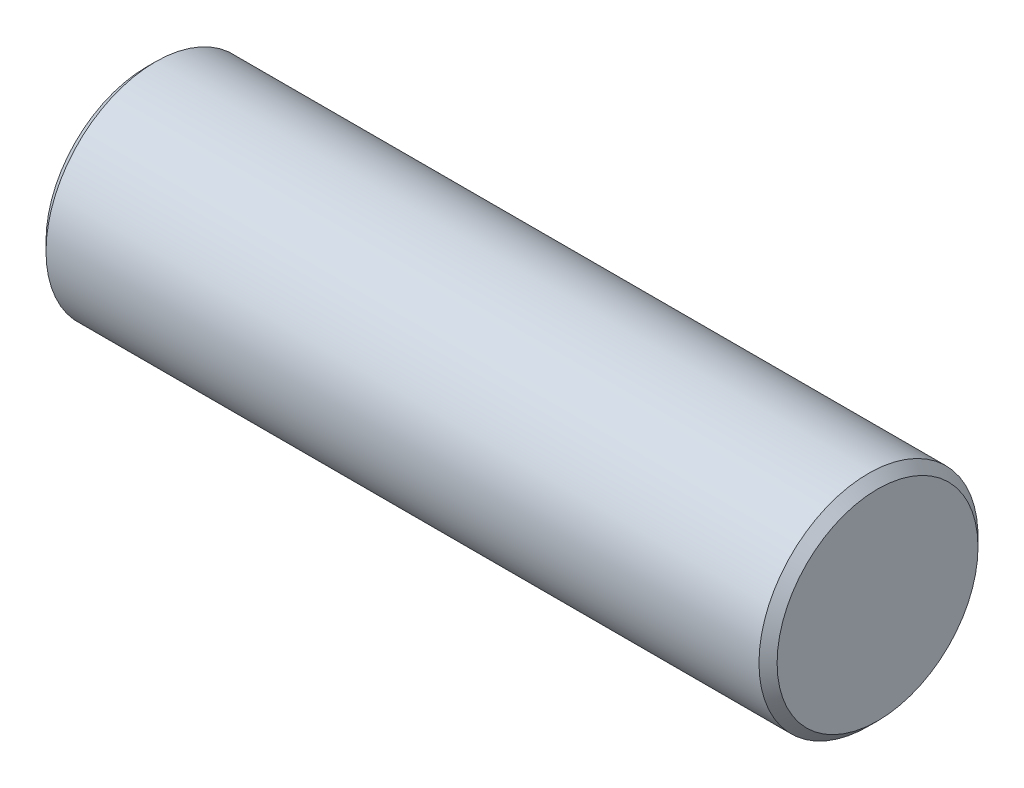
ISO-10303-21;
HEADER;
FILE_DESCRIPTION(('STEP AP214'),'2;1');
FILE_NAME('part.step','',(''),(''),'','','');
FILE_SCHEMA(('AUTOMOTIVE_DESIGN { 1 0 10303 214 1 1 1 1 }'));
ENDSEC;
DATA;
#1=APPLICATION_CONTEXT('core data for automotive mechanical design processes');
#2=APPLICATION_PROTOCOL_DEFINITION('international standard','automotive_design',2000,#1);
#3=PRODUCT_CONTEXT('',#1,'mechanical');
#4=PRODUCT('Part','Part','',(#3));
#5=PRODUCT_RELATED_PRODUCT_CATEGORY('part','',(#4));
#6=PRODUCT_DEFINITION_FORMATION('','',#4);
#7=PRODUCT_DEFINITION_CONTEXT('part definition',#1,'design');
#8=PRODUCT_DEFINITION('design','',#6,#7);
#9=PRODUCT_DEFINITION_SHAPE('','',#8);
#10=(LENGTH_UNIT() NAMED_UNIT(*) SI_UNIT(.MILLI.,.METRE.));
#11=(NAMED_UNIT(*) PLANE_ANGLE_UNIT() SI_UNIT($,.RADIAN.));
#12=(NAMED_UNIT(*) SI_UNIT($,.STERADIAN.) SOLID_ANGLE_UNIT());
#13=UNCERTAINTY_MEASURE_WITH_UNIT(LENGTH_MEASURE(1.E-05),#10,'distance_accuracy_value','');
#14=(GEOMETRIC_REPRESENTATION_CONTEXT(3) GLOBAL_UNCERTAINTY_ASSIGNED_CONTEXT((#13)) GLOBAL_UNIT_ASSIGNED_CONTEXT((#10,
#11,#12)) REPRESENTATION_CONTEXT('',''));
#15=CARTESIAN_POINT('',(0.,0.,0.));
#16=DIRECTION('',(0.,0.,1.));
#17=DIRECTION('',(1.,0.,0.));
#18=AXIS2_PLACEMENT_3D('',#15,#16,#17);
#19=CARTESIAN_POINT('',(-2.5,0.749,0.));
#20=DIRECTION('',(1.,0.,0.));
#21=DIRECTION('',(0.,0.,-1.));
#22=AXIS2_PLACEMENT_3D('',#19,#20,#21);
#23=PLANE('',#22);
#24=CARTESIAN_POINT('',(-2.5,0.,0.));
#25=DIRECTION('',(1.,0.,0.));
#26=DIRECTION('',(0.,0.,-1.));
#27=AXIS2_PLACEMENT_3D('',#24,#25,#26);
#28=CIRCLE('',#27,0.687000000000001);
#29=CARTESIAN_POINT('',(-2.5,0.,-0.687000000000001));
#30=VERTEX_POINT('',#29);
#31=EDGE_CURVE('E10',#30,#30,#28,.F.);
#32=ORIENTED_EDGE('',*,*,#31,.T.);
#33=EDGE_LOOP('',(#32));
#34=FACE_BOUND('',#33,.T.);
#35=ADVANCED_FACE('F37',(#34),#23,.F.);
#36=CARTESIAN_POINT('',(2.5,0.749,0.));
#37=DIRECTION('',(-1.,0.,0.));
#38=DIRECTION('',(0.,0.,1.));
#39=AXIS2_PLACEMENT_3D('',#36,#37,#38);
#40=PLANE('',#39);
#41=CARTESIAN_POINT('',(2.5,0.,0.));
#42=DIRECTION('',(-1.,0.,0.));
#43=DIRECTION('',(0.,0.,1.));
#44=AXIS2_PLACEMENT_3D('',#41,#42,#43);
#45=CIRCLE('',#44,0.687000000000002);
#46=CARTESIAN_POINT('',(2.5,0.,0.687000000000002));
#47=VERTEX_POINT('',#46);
#48=EDGE_CURVE('E45',#47,#47,#45,.F.);
#49=ORIENTED_EDGE('',*,*,#48,.T.);
#50=EDGE_LOOP('',(#49));
#51=FACE_BOUND('',#50,.T.);
#52=ADVANCED_FACE('F69',(#51),#40,.F.);
#53=CARTESIAN_POINT('',(-2.3127458107563,0.,0.));
#54=DIRECTION('',(-1.,0.,0.));
#55=DIRECTION('',(0.,0.,1.));
#56=AXIS2_PLACEMENT_3D('',#53,#54,#55);
#57=CYLINDRICAL_SURFACE('',#56,0.749);
#58=CARTESIAN_POINT('',(2.438,0.,0.));
#59=DIRECTION('',(-1.,0.,0.));
#60=DIRECTION('',(0.,0.,1.));
#61=AXIS2_PLACEMENT_3D('',#58,#59,#60);
#62=CIRCLE('',#61,0.749);
#63=CARTESIAN_POINT('',(2.438,0.,0.749));
#64=VERTEX_POINT('',#63);
#65=EDGE_CURVE('E49',#64,#64,#62,.T.);
#66=ORIENTED_EDGE('',*,*,#65,.T.);
#67=EDGE_LOOP('',(#66));
#68=FACE_BOUND('',#67,.T.);
#69=CARTESIAN_POINT('',(-2.438,0.,0.));
#70=DIRECTION('',(1.,0.,0.));
#71=DIRECTION('',(0.,0.,-1.));
#72=AXIS2_PLACEMENT_3D('',#69,#70,#71);
#73=CIRCLE('',#72,0.749);
#74=CARTESIAN_POINT('',(-2.438,0.,-0.749));
#75=VERTEX_POINT('',#74);
#76=EDGE_CURVE('E53',#75,#75,#73,.T.);
#77=ORIENTED_EDGE('',*,*,#76,.T.);
#78=EDGE_LOOP('',(#77));
#79=FACE_BOUND('',#78,.T.);
#80=ADVANCED_FACE('F59',(#68,#79),#57,.T.);
#81=CARTESIAN_POINT('',(2.438,0.,0.));
#82=DIRECTION('',(-1.,0.,0.));
#83=DIRECTION('',(0.,0.,1.));
#84=AXIS2_PLACEMENT_3D('',#81,#82,#83);
#85=CONICAL_SURFACE('',#84,0.749,0.785398163397441);
#86=ORIENTED_EDGE('',*,*,#48,.F.);
#87=EDGE_LOOP('',(#86));
#88=FACE_BOUND('',#87,.T.);
#89=ORIENTED_EDGE('',*,*,#65,.F.);
#90=EDGE_LOOP('',(#89));
#91=FACE_BOUND('',#90,.T.);
#92=ADVANCED_FACE('F63',(#88,#91),#85,.T.);
#93=CARTESIAN_POINT('',(-2.5,0.,0.));
#94=DIRECTION('',(1.,0.,0.));
#95=DIRECTION('',(0.,0.,-1.));
#96=AXIS2_PLACEMENT_3D('',#93,#94,#95);
#97=CONICAL_SURFACE('',#96,0.687000000000001,0.785398163397444);
#98=ORIENTED_EDGE('',*,*,#76,.F.);
#99=EDGE_LOOP('',(#98));
#100=FACE_BOUND('',#99,.T.);
#101=ORIENTED_EDGE('',*,*,#31,.F.);
#102=EDGE_LOOP('',(#101));
#103=FACE_BOUND('',#102,.T.);
#104=ADVANCED_FACE('F40',(#100,#103),#97,.T.);
#105=CLOSED_SHELL('',(#35,#52,#80,#92,#104));
#106=MANIFOLD_SOLID_BREP('B2',#105);
#107=ADVANCED_BREP_SHAPE_REPRESENTATION('',(#18,#106),#14);
#108=SHAPE_DEFINITION_REPRESENTATION(#9,#107);
ENDSEC;
END-ISO-10303-21;
